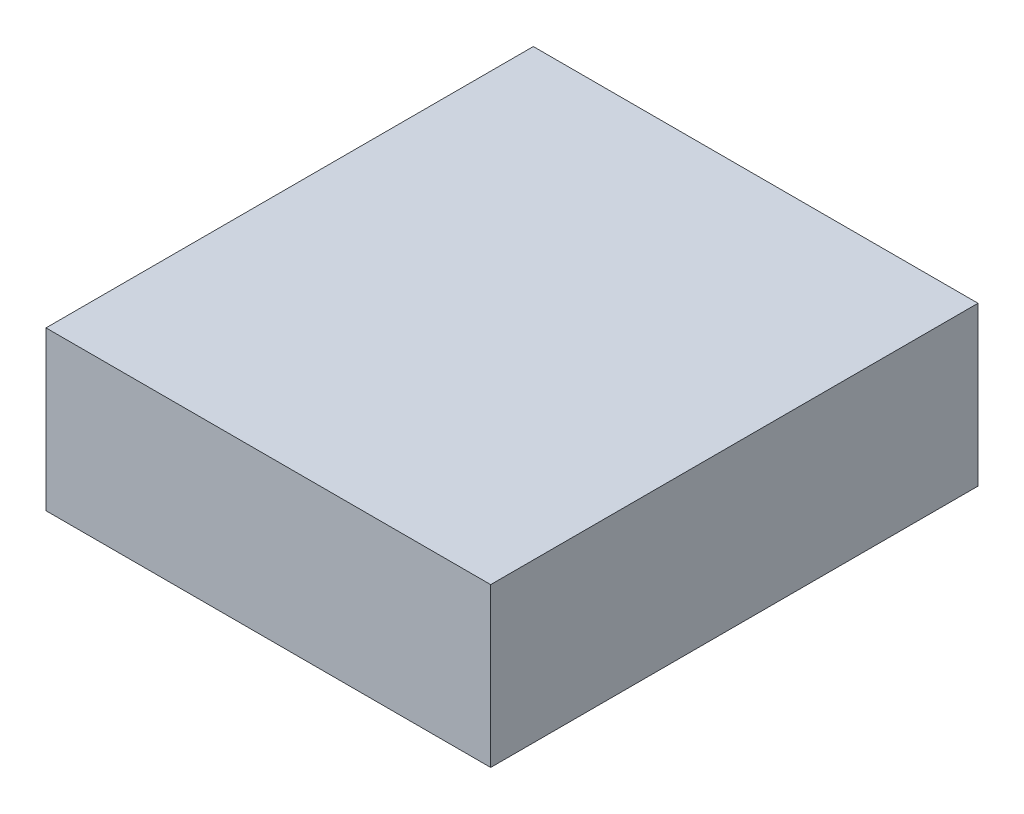
ISO-10303-21;
HEADER;
FILE_DESCRIPTION(('STEP AP214'),'2;1');
FILE_NAME('part.step','',(''),(''),'','','');
FILE_SCHEMA(('AUTOMOTIVE_DESIGN { 1 0 10303 214 1 1 1 1 }'));
ENDSEC;
DATA;
#1=APPLICATION_CONTEXT('core data for automotive mechanical design processes');
#2=APPLICATION_PROTOCOL_DEFINITION('international standard','automotive_design',2000,#1);
#3=PRODUCT_CONTEXT('',#1,'mechanical');
#4=PRODUCT('Part','Part','',(#3));
#5=PRODUCT_RELATED_PRODUCT_CATEGORY('part','',(#4));
#6=PRODUCT_DEFINITION_FORMATION('','',#4);
#7=PRODUCT_DEFINITION_CONTEXT('part definition',#1,'design');
#8=PRODUCT_DEFINITION('design','',#6,#7);
#9=PRODUCT_DEFINITION_SHAPE('','',#8);
#10=(LENGTH_UNIT() NAMED_UNIT(*) SI_UNIT(.MILLI.,.METRE.));
#11=(NAMED_UNIT(*) PLANE_ANGLE_UNIT() SI_UNIT($,.RADIAN.));
#12=(NAMED_UNIT(*) SI_UNIT($,.STERADIAN.) SOLID_ANGLE_UNIT());
#13=UNCERTAINTY_MEASURE_WITH_UNIT(LENGTH_MEASURE(1.E-05),#10,'distance_accuracy_value','');
#14=(GEOMETRIC_REPRESENTATION_CONTEXT(3) GLOBAL_UNCERTAINTY_ASSIGNED_CONTEXT((#13)) GLOBAL_UNIT_ASSIGNED_CONTEXT((#10,
#11,#12)) REPRESENTATION_CONTEXT('',''));
#15=CARTESIAN_POINT('',(0.,0.,0.));
#16=DIRECTION('',(0.,0.,1.));
#17=DIRECTION('',(1.,0.,0.));
#18=AXIS2_PLACEMENT_3D('',#15,#16,#17);
#19=CARTESIAN_POINT('',(0.,0.13,0.));
#20=DIRECTION('',(0.,1.,0.));
#21=DIRECTION('',(0.,0.,1.));
#22=AXIS2_PLACEMENT_3D('',#19,#20,#21);
#23=PLANE('',#22);
#24=DIRECTION('',(0.,0.,1.));
#25=VECTOR('',#24,1.);
#26=CARTESIAN_POINT('',(-0.1825,0.13,0.));
#27=LINE('',#26,#25);
#28=CARTESIAN_POINT('',(-0.1825,0.13,-0.2));
#29=VERTEX_POINT('',#28);
#30=CARTESIAN_POINT('',(-0.1825,0.13,0.2));
#31=VERTEX_POINT('',#30);
#32=EDGE_CURVE('E11',#29,#31,#27,.T.);
#33=ORIENTED_EDGE('',*,*,#32,.T.);
#34=DIRECTION('',(1.,0.,0.));
#35=VECTOR('',#34,1.);
#36=CARTESIAN_POINT('',(0.,0.13,0.2));
#37=LINE('',#36,#35);
#38=CARTESIAN_POINT('',(0.1825,0.13,0.2));
#39=VERTEX_POINT('',#38);
#40=EDGE_CURVE('E25',#31,#39,#37,.T.);
#41=ORIENTED_EDGE('',*,*,#40,.T.);
#42=DIRECTION('',(0.,0.,-1.));
#43=VECTOR('',#42,1.);
#44=CARTESIAN_POINT('',(0.1825,0.13,0.));
#45=LINE('',#44,#43);
#46=CARTESIAN_POINT('',(0.1825,0.13,-0.2));
#47=VERTEX_POINT('',#46);
#48=EDGE_CURVE('E69',#39,#47,#45,.T.);
#49=ORIENTED_EDGE('',*,*,#48,.T.);
#50=DIRECTION('',(-1.,0.,0.));
#51=VECTOR('',#50,1.);
#52=CARTESIAN_POINT('',(0.,0.13,-0.2));
#53=LINE('',#52,#51);
#54=EDGE_CURVE('E92',#47,#29,#53,.T.);
#55=ORIENTED_EDGE('',*,*,#54,.T.);
#56=EDGE_LOOP('',(#33,#41,#49,#55));
#57=FACE_BOUND('',#56,.T.);
#58=ADVANCED_FACE('F17',(#57),#23,.T.);
#59=CARTESIAN_POINT('',(-0.1825,0.13,-0.2));
#60=DIRECTION('',(0.,0.,1.));
#61=DIRECTION('',(1.,0.,0.));
#62=AXIS2_PLACEMENT_3D('',#59,#60,#61);
#63=PLANE('',#62);
#64=DIRECTION('',(0.,1.,0.));
#65=VECTOR('',#64,1.);
#66=CARTESIAN_POINT('',(-0.1825,0.13,-0.2));
#67=LINE('',#66,#65);
#68=CARTESIAN_POINT('',(-0.1825,0.,-0.2));
#69=VERTEX_POINT('',#68);
#70=EDGE_CURVE('E87',#69,#29,#67,.T.);
#71=ORIENTED_EDGE('',*,*,#70,.T.);
#72=ORIENTED_EDGE('',*,*,#54,.F.);
#73=DIRECTION('',(0.,1.,0.));
#74=VECTOR('',#73,1.);
#75=CARTESIAN_POINT('',(0.1825,0.13,-0.2));
#76=LINE('',#75,#74);
#77=CARTESIAN_POINT('',(0.1825,0.,-0.2));
#78=VERTEX_POINT('',#77);
#79=EDGE_CURVE('E76',#78,#47,#76,.T.);
#80=ORIENTED_EDGE('',*,*,#79,.F.);
#81=DIRECTION('',(1.,0.,0.));
#82=VECTOR('',#81,1.);
#83=CARTESIAN_POINT('',(-0.1825,0.,-0.2));
#84=LINE('',#83,#82);
#85=EDGE_CURVE('E61',#69,#78,#84,.T.);
#86=ORIENTED_EDGE('',*,*,#85,.F.);
#87=EDGE_LOOP('',(#71,#72,#80,#86));
#88=FACE_BOUND('',#87,.T.);
#89=ADVANCED_FACE('F105',(#88),#63,.F.);
#90=CARTESIAN_POINT('',(0.,0.,0.));
#91=DIRECTION('',(0.,1.,0.));
#92=DIRECTION('',(0.,0.,1.));
#93=AXIS2_PLACEMENT_3D('',#90,#91,#92);
#94=PLANE('',#93);
#95=DIRECTION('',(-1.,0.,0.));
#96=VECTOR('',#95,1.);
#97=CARTESIAN_POINT('',(-0.1825,0.,0.2));
#98=LINE('',#97,#96);
#99=CARTESIAN_POINT('',(0.1825,0.,0.2));
#100=VERTEX_POINT('',#99);
#101=CARTESIAN_POINT('',(-0.1825,0.,0.2));
#102=VERTEX_POINT('',#101);
#103=EDGE_CURVE('E59',#100,#102,#98,.T.);
#104=ORIENTED_EDGE('',*,*,#103,.T.);
#105=DIRECTION('',(0.,0.,-1.));
#106=VECTOR('',#105,1.);
#107=CARTESIAN_POINT('',(-0.1825,0.,-0.2));
#108=LINE('',#107,#106);
#109=EDGE_CURVE('E64',#102,#69,#108,.T.);
#110=ORIENTED_EDGE('',*,*,#109,.T.);
#111=ORIENTED_EDGE('',*,*,#85,.T.);
#112=DIRECTION('',(0.,0.,1.));
#113=VECTOR('',#112,1.);
#114=CARTESIAN_POINT('',(0.1825,0.,-0.2));
#115=LINE('',#114,#113);
#116=EDGE_CURVE('E54',#78,#100,#115,.T.);
#117=ORIENTED_EDGE('',*,*,#116,.T.);
#118=EDGE_LOOP('',(#104,#110,#111,#117));
#119=FACE_BOUND('',#118,.T.);
#120=ADVANCED_FACE('F56',(#119),#94,.F.);
#121=CARTESIAN_POINT('',(0.1825,0.13,-0.2));
#122=DIRECTION('',(-1.,0.,0.));
#123=DIRECTION('',(0.,0.,1.));
#124=AXIS2_PLACEMENT_3D('',#121,#122,#123);
#125=PLANE('',#124);
#126=ORIENTED_EDGE('',*,*,#79,.T.);
#127=ORIENTED_EDGE('',*,*,#48,.F.);
#128=DIRECTION('',(0.,-1.,0.));
#129=VECTOR('',#128,1.);
#130=CARTESIAN_POINT('',(0.1825,0.13,0.2));
#131=LINE('',#130,#129);
#132=EDGE_CURVE('E65',#39,#100,#131,.T.);
#133=ORIENTED_EDGE('',*,*,#132,.T.);
#134=ORIENTED_EDGE('',*,*,#116,.F.);
#135=EDGE_LOOP('',(#126,#127,#133,#134));
#136=FACE_BOUND('',#135,.T.);
#137=ADVANCED_FACE('F68',(#136),#125,.F.);
#138=CARTESIAN_POINT('',(-0.1825,0.13,0.2));
#139=DIRECTION('',(0.,0.,-1.));
#140=DIRECTION('',(-1.,0.,0.));
#141=AXIS2_PLACEMENT_3D('',#138,#139,#140);
#142=PLANE('',#141);
#143=ORIENTED_EDGE('',*,*,#132,.F.);
#144=ORIENTED_EDGE('',*,*,#40,.F.);
#145=DIRECTION('',(0.,1.,0.));
#146=VECTOR('',#145,1.);
#147=CARTESIAN_POINT('',(-0.1825,0.13,0.2));
#148=LINE('',#147,#146);
#149=EDGE_CURVE('E71',#102,#31,#148,.T.);
#150=ORIENTED_EDGE('',*,*,#149,.F.);
#151=ORIENTED_EDGE('',*,*,#103,.F.);
#152=EDGE_LOOP('',(#143,#144,#150,#151));
#153=FACE_BOUND('',#152,.T.);
#154=ADVANCED_FACE('F73',(#153),#142,.F.);
#155=CARTESIAN_POINT('',(-0.1825,0.13,-0.2));
#156=DIRECTION('',(1.,0.,0.));
#157=DIRECTION('',(0.,0.,-1.));
#158=AXIS2_PLACEMENT_3D('',#155,#156,#157);
#159=PLANE('',#158);
#160=ORIENTED_EDGE('',*,*,#149,.T.);
#161=ORIENTED_EDGE('',*,*,#32,.F.);
#162=ORIENTED_EDGE('',*,*,#70,.F.);
#163=ORIENTED_EDGE('',*,*,#109,.F.);
#164=EDGE_LOOP('',(#160,#161,#162,#163));
#165=FACE_BOUND('',#164,.T.);
#166=ADVANCED_FACE('F108',(#165),#159,.F.);
#167=CLOSED_SHELL('',(#58,#89,#120,#137,#154,#166));
#168=MANIFOLD_SOLID_BREP('B1',#167);
#169=ADVANCED_BREP_SHAPE_REPRESENTATION('',(#18,#168),#14);
#170=SHAPE_DEFINITION_REPRESENTATION(#9,#169);
ENDSEC;
END-ISO-10303-21;
